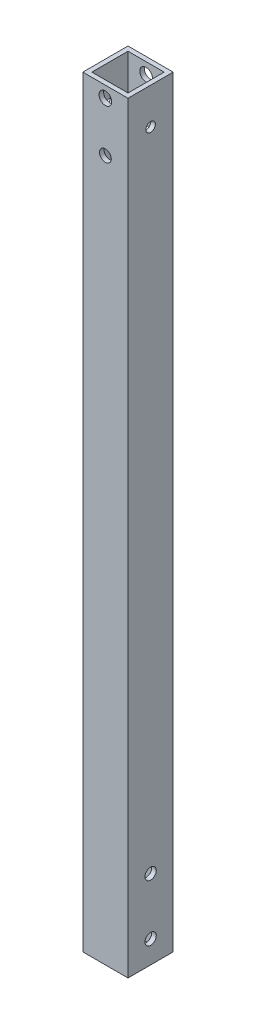
ISO-10303-21;
HEADER;
FILE_DESCRIPTION(('STEP AP214'),'2;1');
FILE_NAME('part.step','',(''),(''),'','','');
FILE_SCHEMA(('AUTOMOTIVE_DESIGN { 1 0 10303 214 1 1 1 1 }'));
ENDSEC;
DATA;
#1=APPLICATION_CONTEXT('core data for automotive mechanical design processes');
#2=APPLICATION_PROTOCOL_DEFINITION('international standard','automotive_design',2000,#1);
#3=PRODUCT_CONTEXT('',#1,'mechanical');
#4=PRODUCT('Part','Part','',(#3));
#5=PRODUCT_RELATED_PRODUCT_CATEGORY('part','',(#4));
#6=PRODUCT_DEFINITION_FORMATION('','',#4);
#7=PRODUCT_DEFINITION_CONTEXT('part definition',#1,'design');
#8=PRODUCT_DEFINITION('design','',#6,#7);
#9=PRODUCT_DEFINITION_SHAPE('','',#8);
#10=(LENGTH_UNIT() NAMED_UNIT(*) SI_UNIT(.MILLI.,.METRE.));
#11=(NAMED_UNIT(*) PLANE_ANGLE_UNIT() SI_UNIT($,.RADIAN.));
#12=(NAMED_UNIT(*) SI_UNIT($,.STERADIAN.) SOLID_ANGLE_UNIT());
#13=UNCERTAINTY_MEASURE_WITH_UNIT(LENGTH_MEASURE(1.E-05),#10,'distance_accuracy_value','');
#14=(GEOMETRIC_REPRESENTATION_CONTEXT(3) GLOBAL_UNCERTAINTY_ASSIGNED_CONTEXT((#13)) GLOBAL_UNIT_ASSIGNED_CONTEXT((#10,
#11,#12)) REPRESENTATION_CONTEXT('',''));
#15=CARTESIAN_POINT('',(0.,0.,0.));
#16=DIRECTION('',(0.,0.,1.));
#17=DIRECTION('',(1.,0.,0.));
#18=AXIS2_PLACEMENT_3D('',#15,#16,#17);
#19=CARTESIAN_POINT('',(0.,337.,0.));
#20=DIRECTION('',(0.,1.,0.));
#21=DIRECTION('',(0.,0.,1.));
#22=AXIS2_PLACEMENT_3D('',#19,#20,#21);
#23=PLANE('',#22);
#24=DIRECTION('',(0.,0.,1.));
#25=VECTOR('',#24,1.);
#26=CARTESIAN_POINT('',(0.,337.,0.));
#27=LINE('',#26,#25);
#28=CARTESIAN_POINT('',(0.,337.,-20.));
#29=VERTEX_POINT('',#28);
#30=CARTESIAN_POINT('',(0.,337.,0.));
#31=VERTEX_POINT('',#30);
#32=EDGE_CURVE('E166',#29,#31,#27,.T.);
#33=ORIENTED_EDGE('',*,*,#32,.T.);
#34=DIRECTION('',(1.,0.,0.));
#35=VECTOR('',#34,1.);
#36=CARTESIAN_POINT('',(0.,337.,0.));
#37=LINE('',#36,#35);
#38=CARTESIAN_POINT('',(20.,337.,0.));
#39=VERTEX_POINT('',#38);
#40=EDGE_CURVE('E169',#31,#39,#37,.T.);
#41=ORIENTED_EDGE('',*,*,#40,.T.);
#42=DIRECTION('',(0.,0.,-1.));
#43=VECTOR('',#42,1.);
#44=CARTESIAN_POINT('',(20.,337.,0.));
#45=LINE('',#44,#43);
#46=CARTESIAN_POINT('',(20.,337.,-20.));
#47=VERTEX_POINT('',#46);
#48=EDGE_CURVE('E172',#39,#47,#45,.T.);
#49=ORIENTED_EDGE('',*,*,#48,.T.);
#50=DIRECTION('',(-1.,0.,0.));
#51=VECTOR('',#50,1.);
#52=CARTESIAN_POINT('',(0.,337.,-20.));
#53=LINE('',#52,#51);
#54=EDGE_CURVE('E174',#47,#29,#53,.T.);
#55=ORIENTED_EDGE('',*,*,#54,.T.);
#56=EDGE_LOOP('',(#33,#41,#49,#55));
#57=FACE_BOUND('',#56,.T.);
#58=DIRECTION('',(1.,0.,0.));
#59=VECTOR('',#58,1.);
#60=CARTESIAN_POINT('',(0.,337.,-2.));
#61=LINE('',#60,#59);
#62=CARTESIAN_POINT('',(2.,337.,-2.));
#63=VERTEX_POINT('',#62);
#64=CARTESIAN_POINT('',(18.,337.,-2.));
#65=VERTEX_POINT('',#64);
#66=EDGE_CURVE('E136',#63,#65,#61,.T.);
#67=ORIENTED_EDGE('',*,*,#66,.F.);
#68=DIRECTION('',(0.,0.,1.));
#69=VECTOR('',#68,1.);
#70=CARTESIAN_POINT('',(2.,337.,0.));
#71=LINE('',#70,#69);
#72=CARTESIAN_POINT('',(2.,337.,-18.));
#73=VERTEX_POINT('',#72);
#74=EDGE_CURVE('E128',#73,#63,#71,.T.);
#75=ORIENTED_EDGE('',*,*,#74,.F.);
#76=DIRECTION('',(-1.,0.,0.));
#77=VECTOR('',#76,1.);
#78=CARTESIAN_POINT('',(0.,337.,-18.));
#79=LINE('',#78,#77);
#80=CARTESIAN_POINT('',(18.,337.,-18.));
#81=VERTEX_POINT('',#80);
#82=EDGE_CURVE('E150',#81,#73,#79,.T.);
#83=ORIENTED_EDGE('',*,*,#82,.F.);
#84=DIRECTION('',(0.,0.,-1.));
#85=VECTOR('',#84,1.);
#86=CARTESIAN_POINT('',(18.,337.,0.));
#87=LINE('',#86,#85);
#88=EDGE_CURVE('E148',#65,#81,#87,.T.);
#89=ORIENTED_EDGE('',*,*,#88,.F.);
#90=EDGE_LOOP('',(#67,#75,#83,#89));
#91=FACE_BOUND('',#90,.T.);
#92=ADVANCED_FACE('F61',(#57,#91),#23,.T.);
#93=CARTESIAN_POINT('',(0.,0.,0.));
#94=DIRECTION('',(0.,1.,0.));
#95=DIRECTION('',(0.,0.,1.));
#96=AXIS2_PLACEMENT_3D('',#93,#94,#95);
#97=PLANE('',#96);
#98=DIRECTION('',(0.,0.,1.));
#99=VECTOR('',#98,1.);
#100=CARTESIAN_POINT('',(0.,0.,0.));
#101=LINE('',#100,#99);
#102=CARTESIAN_POINT('',(0.,0.,-20.));
#103=VERTEX_POINT('',#102);
#104=CARTESIAN_POINT('',(0.,0.,0.));
#105=VERTEX_POINT('',#104);
#106=EDGE_CURVE('E144',#103,#105,#101,.T.);
#107=ORIENTED_EDGE('',*,*,#106,.F.);
#108=DIRECTION('',(-1.,0.,0.));
#109=VECTOR('',#108,1.);
#110=CARTESIAN_POINT('',(0.,0.,-20.));
#111=LINE('',#110,#109);
#112=CARTESIAN_POINT('',(20.,0.,-20.));
#113=VERTEX_POINT('',#112);
#114=EDGE_CURVE('E170',#113,#103,#111,.T.);
#115=ORIENTED_EDGE('',*,*,#114,.F.);
#116=DIRECTION('',(0.,0.,-1.));
#117=VECTOR('',#116,1.);
#118=CARTESIAN_POINT('',(20.,0.,0.));
#119=LINE('',#118,#117);
#120=CARTESIAN_POINT('',(20.,0.,0.));
#121=VERTEX_POINT('',#120);
#122=EDGE_CURVE('E181',#121,#113,#119,.T.);
#123=ORIENTED_EDGE('',*,*,#122,.F.);
#124=DIRECTION('',(1.,0.,0.));
#125=VECTOR('',#124,1.);
#126=CARTESIAN_POINT('',(0.,0.,0.));
#127=LINE('',#126,#125);
#128=EDGE_CURVE('E179',#105,#121,#127,.T.);
#129=ORIENTED_EDGE('',*,*,#128,.F.);
#130=EDGE_LOOP('',(#107,#115,#123,#129));
#131=FACE_BOUND('',#130,.T.);
#132=DIRECTION('',(0.,0.,1.));
#133=VECTOR('',#132,1.);
#134=CARTESIAN_POINT('',(2.,0.,0.));
#135=LINE('',#134,#133);
#136=CARTESIAN_POINT('',(2.,0.,-18.));
#137=VERTEX_POINT('',#136);
#138=CARTESIAN_POINT('',(2.,0.,-2.));
#139=VERTEX_POINT('',#138);
#140=EDGE_CURVE('E86',#137,#139,#135,.T.);
#141=ORIENTED_EDGE('',*,*,#140,.T.);
#142=DIRECTION('',(1.,0.,0.));
#143=VECTOR('',#142,1.);
#144=CARTESIAN_POINT('',(0.,0.,-2.));
#145=LINE('',#144,#143);
#146=CARTESIAN_POINT('',(18.,0.,-2.));
#147=VERTEX_POINT('',#146);
#148=EDGE_CURVE('E143',#139,#147,#145,.T.);
#149=ORIENTED_EDGE('',*,*,#148,.T.);
#150=DIRECTION('',(0.,0.,-1.));
#151=VECTOR('',#150,1.);
#152=CARTESIAN_POINT('',(18.,0.,0.));
#153=LINE('',#152,#151);
#154=CARTESIAN_POINT('',(18.,0.,-18.));
#155=VERTEX_POINT('',#154);
#156=EDGE_CURVE('E158',#147,#155,#153,.T.);
#157=ORIENTED_EDGE('',*,*,#156,.T.);
#158=DIRECTION('',(-1.,0.,0.));
#159=VECTOR('',#158,1.);
#160=CARTESIAN_POINT('',(0.,0.,-18.));
#161=LINE('',#160,#159);
#162=EDGE_CURVE('E137',#155,#137,#161,.T.);
#163=ORIENTED_EDGE('',*,*,#162,.T.);
#164=EDGE_LOOP('',(#141,#149,#157,#163));
#165=FACE_BOUND('',#164,.T.);
#166=ADVANCED_FACE('F254',(#131,#165),#97,.F.);
#167=CARTESIAN_POINT('',(0.,337.,0.));
#168=DIRECTION('',(1.,0.,0.));
#169=DIRECTION('',(0.,0.,-1.));
#170=AXIS2_PLACEMENT_3D('',#167,#168,#169);
#171=PLANE('',#170);
#172=CARTESIAN_POINT('',(0.,321.,-10.));
#173=DIRECTION('',(1.,0.,0.));
#174=DIRECTION('',(0.,0.,-1.));
#175=AXIS2_PLACEMENT_3D('',#172,#173,#174);
#176=CIRCLE('',#175,2.1);
#177=CARTESIAN_POINT('',(0.,321.,-12.1));
#178=VERTEX_POINT('',#177);
#179=EDGE_CURVE('E332',#178,#178,#176,.T.);
#180=ORIENTED_EDGE('',*,*,#179,.T.);
#181=EDGE_LOOP('',(#180));
#182=FACE_BOUND('',#181,.T.);
#183=CARTESIAN_POINT('',(0.,34.9999999999969,-10.0000000000083));
#184=DIRECTION('',(-1.,0.,0.));
#185=DIRECTION('',(0.,0.,1.));
#186=AXIS2_PLACEMENT_3D('',#183,#184,#185);
#187=CIRCLE('',#186,2.5);
#188=CARTESIAN_POINT('',(0.,34.9999999999969,-7.50000000000833));
#189=VERTEX_POINT('',#188);
#190=EDGE_CURVE('E221',#189,#189,#187,.T.);
#191=ORIENTED_EDGE('',*,*,#190,.F.);
#192=EDGE_LOOP('',(#191));
#193=FACE_BOUND('',#192,.T.);
#194=CARTESIAN_POINT('',(0.,10.,-10.0000000000083));
#195=DIRECTION('',(-1.,0.,0.));
#196=DIRECTION('',(0.,0.,1.));
#197=AXIS2_PLACEMENT_3D('',#194,#195,#196);
#198=CIRCLE('',#197,2.5);
#199=CARTESIAN_POINT('',(0.,10.,-7.50000000000833));
#200=VERTEX_POINT('',#199);
#201=EDGE_CURVE('E209',#200,#200,#198,.T.);
#202=ORIENTED_EDGE('',*,*,#201,.F.);
#203=EDGE_LOOP('',(#202));
#204=FACE_BOUND('',#203,.T.);
#205=ORIENTED_EDGE('',*,*,#106,.T.);
#206=DIRECTION('',(0.,-1.,0.));
#207=VECTOR('',#206,1.);
#208=CARTESIAN_POINT('',(0.,337.,0.));
#209=LINE('',#208,#207);
#210=EDGE_CURVE('E12',#31,#105,#209,.T.);
#211=ORIENTED_EDGE('',*,*,#210,.F.);
#212=ORIENTED_EDGE('',*,*,#32,.F.);
#213=DIRECTION('',(0.,-1.,0.));
#214=VECTOR('',#213,1.);
#215=CARTESIAN_POINT('',(0.,337.,-20.));
#216=LINE('',#215,#214);
#217=EDGE_CURVE('E176',#29,#103,#216,.T.);
#218=ORIENTED_EDGE('',*,*,#217,.T.);
#219=EDGE_LOOP('',(#205,#211,#212,#218));
#220=FACE_BOUND('',#219,.T.);
#221=ADVANCED_FACE('F63',(#182,#193,#204,#220),#171,.F.);
#222=CARTESIAN_POINT('',(0.,337.,0.));
#223=DIRECTION('',(0.,0.,-1.));
#224=DIRECTION('',(-1.,0.,0.));
#225=AXIS2_PLACEMENT_3D('',#222,#223,#224);
#226=PLANE('',#225);
#227=CARTESIAN_POINT('',(9.99999999999981,310.,0.));
#228=DIRECTION('',(0.,0.,-1.));
#229=DIRECTION('',(-1.,0.,0.));
#230=AXIS2_PLACEMENT_3D('',#227,#228,#229);
#231=CIRCLE('',#230,2.6);
#232=CARTESIAN_POINT('',(7.39999999999981,310.,0.));
#233=VERTEX_POINT('',#232);
#234=EDGE_CURVE('E202',#233,#233,#231,.T.);
#235=ORIENTED_EDGE('',*,*,#234,.T.);
#236=EDGE_LOOP('',(#235));
#237=FACE_BOUND('',#236,.T.);
#238=CARTESIAN_POINT('',(9.99999999999982,332.,0.));
#239=DIRECTION('',(0.,0.,-1.));
#240=DIRECTION('',(-1.,0.,0.));
#241=AXIS2_PLACEMENT_3D('',#238,#239,#240);
#242=CIRCLE('',#241,2.8);
#243=CARTESIAN_POINT('',(7.19999999999981,332.,0.));
#244=VERTEX_POINT('',#243);
#245=EDGE_CURVE('E344',#244,#244,#242,.T.);
#246=ORIENTED_EDGE('',*,*,#245,.T.);
#247=EDGE_LOOP('',(#246));
#248=FACE_BOUND('',#247,.T.);
#249=ORIENTED_EDGE('',*,*,#128,.T.);
#250=DIRECTION('',(0.,-1.,0.));
#251=VECTOR('',#250,1.);
#252=CARTESIAN_POINT('',(20.,337.,0.));
#253=LINE('',#252,#251);
#254=EDGE_CURVE('E70',#39,#121,#253,.T.);
#255=ORIENTED_EDGE('',*,*,#254,.F.);
#256=ORIENTED_EDGE('',*,*,#40,.F.);
#257=ORIENTED_EDGE('',*,*,#210,.T.);
#258=EDGE_LOOP('',(#249,#255,#256,#257));
#259=FACE_BOUND('',#258,.T.);
#260=ADVANCED_FACE('F253',(#237,#248,#259),#226,.F.);
#261=CARTESIAN_POINT('',(20.,337.,0.));
#262=DIRECTION('',(-1.,0.,0.));
#263=DIRECTION('',(0.,0.,1.));
#264=AXIS2_PLACEMENT_3D('',#261,#262,#263);
#265=PLANE('',#264);
#266=CARTESIAN_POINT('',(20.,321.,-10.));
#267=DIRECTION('',(1.,0.,0.));
#268=DIRECTION('',(0.,0.,-1.));
#269=AXIS2_PLACEMENT_3D('',#266,#267,#268);
#270=CIRCLE('',#269,2.1);
#271=CARTESIAN_POINT('',(20.,321.,-12.1));
#272=VERTEX_POINT('',#271);
#273=EDGE_CURVE('E331',#272,#272,#270,.T.);
#274=ORIENTED_EDGE('',*,*,#273,.F.);
#275=EDGE_LOOP('',(#274));
#276=FACE_BOUND('',#275,.T.);
#277=CARTESIAN_POINT('',(20.,34.9999999999969,-10.0000000000083));
#278=DIRECTION('',(-1.,0.,0.));
#279=DIRECTION('',(0.,0.,1.));
#280=AXIS2_PLACEMENT_3D('',#277,#278,#279);
#281=CIRCLE('',#280,2.5);
#282=CARTESIAN_POINT('',(20.,34.9999999999969,-7.50000000000833));
#283=VERTEX_POINT('',#282);
#284=EDGE_CURVE('E195',#283,#283,#281,.T.);
#285=ORIENTED_EDGE('',*,*,#284,.T.);
#286=EDGE_LOOP('',(#285));
#287=FACE_BOUND('',#286,.T.);
#288=CARTESIAN_POINT('',(20.,10.,-10.0000000000083));
#289=DIRECTION('',(-1.,0.,0.));
#290=DIRECTION('',(0.,0.,1.));
#291=AXIS2_PLACEMENT_3D('',#288,#289,#290);
#292=CIRCLE('',#291,2.5);
#293=CARTESIAN_POINT('',(20.,10.,-7.50000000000833));
#294=VERTEX_POINT('',#293);
#295=EDGE_CURVE('E224',#294,#294,#292,.T.);
#296=ORIENTED_EDGE('',*,*,#295,.T.);
#297=EDGE_LOOP('',(#296));
#298=FACE_BOUND('',#297,.T.);
#299=ORIENTED_EDGE('',*,*,#122,.T.);
#300=DIRECTION('',(0.,-1.,0.));
#301=VECTOR('',#300,1.);
#302=CARTESIAN_POINT('',(20.,337.,-20.));
#303=LINE('',#302,#301);
#304=EDGE_CURVE('E186',#47,#113,#303,.T.);
#305=ORIENTED_EDGE('',*,*,#304,.F.);
#306=ORIENTED_EDGE('',*,*,#48,.F.);
#307=ORIENTED_EDGE('',*,*,#254,.T.);
#308=EDGE_LOOP('',(#299,#305,#306,#307));
#309=FACE_BOUND('',#308,.T.);
#310=ADVANCED_FACE('F272',(#276,#287,#298,#309),#265,.F.);
#311=CARTESIAN_POINT('',(0.,337.,-20.));
#312=DIRECTION('',(0.,0.,1.));
#313=DIRECTION('',(1.,0.,0.));
#314=AXIS2_PLACEMENT_3D('',#311,#312,#313);
#315=PLANE('',#314);
#316=CARTESIAN_POINT('',(9.99999999999981,310.,-20.));
#317=DIRECTION('',(0.,0.,-1.));
#318=DIRECTION('',(-1.,0.,0.));
#319=AXIS2_PLACEMENT_3D('',#316,#317,#318);
#320=CIRCLE('',#319,2.6);
#321=CARTESIAN_POINT('',(7.39999999999981,310.,-20.));
#322=VERTEX_POINT('',#321);
#323=EDGE_CURVE('E342',#322,#322,#320,.T.);
#324=ORIENTED_EDGE('',*,*,#323,.F.);
#325=EDGE_LOOP('',(#324));
#326=FACE_BOUND('',#325,.T.);
#327=CARTESIAN_POINT('',(9.99999999999982,332.,-20.));
#328=DIRECTION('',(0.,0.,-1.));
#329=DIRECTION('',(-1.,0.,0.));
#330=AXIS2_PLACEMENT_3D('',#327,#328,#329);
#331=CIRCLE('',#330,2.8);
#332=CARTESIAN_POINT('',(7.19999999999981,332.,-20.));
#333=VERTEX_POINT('',#332);
#334=EDGE_CURVE('E216',#333,#333,#331,.T.);
#335=ORIENTED_EDGE('',*,*,#334,.F.);
#336=EDGE_LOOP('',(#335));
#337=FACE_BOUND('',#336,.T.);
#338=ORIENTED_EDGE('',*,*,#114,.T.);
#339=ORIENTED_EDGE('',*,*,#217,.F.);
#340=ORIENTED_EDGE('',*,*,#54,.F.);
#341=ORIENTED_EDGE('',*,*,#304,.T.);
#342=EDGE_LOOP('',(#338,#339,#340,#341));
#343=FACE_BOUND('',#342,.T.);
#344=ADVANCED_FACE('F238',(#326,#337,#343),#315,.F.);
#345=CARTESIAN_POINT('',(2.,337.,0.));
#346=DIRECTION('',(1.,0.,0.));
#347=DIRECTION('',(0.,0.,-1.));
#348=AXIS2_PLACEMENT_3D('',#345,#346,#347);
#349=PLANE('',#348);
#350=CARTESIAN_POINT('',(2.,321.,-10.));
#351=DIRECTION('',(1.,0.,0.));
#352=DIRECTION('',(0.,0.,-1.));
#353=AXIS2_PLACEMENT_3D('',#350,#351,#352);
#354=CIRCLE('',#353,2.1);
#355=CARTESIAN_POINT('',(2.,321.,-12.1));
#356=VERTEX_POINT('',#355);
#357=EDGE_CURVE('E337',#356,#356,#354,.T.);
#358=ORIENTED_EDGE('',*,*,#357,.F.);
#359=EDGE_LOOP('',(#358));
#360=FACE_BOUND('',#359,.T.);
#361=CARTESIAN_POINT('',(2.,34.9999999999969,-10.0000000000083));
#362=DIRECTION('',(1.,0.,0.));
#363=DIRECTION('',(0.,0.,-1.));
#364=AXIS2_PLACEMENT_3D('',#361,#362,#363);
#365=CIRCLE('',#364,2.5);
#366=CARTESIAN_POINT('',(2.,34.9999999999969,-12.5000000000083));
#367=VERTEX_POINT('',#366);
#368=EDGE_CURVE('E156',#367,#367,#365,.T.);
#369=ORIENTED_EDGE('',*,*,#368,.F.);
#370=EDGE_LOOP('',(#369));
#371=FACE_BOUND('',#370,.T.);
#372=CARTESIAN_POINT('',(2.,10.,-10.0000000000083));
#373=DIRECTION('',(1.,0.,0.));
#374=DIRECTION('',(0.,0.,-1.));
#375=AXIS2_PLACEMENT_3D('',#372,#373,#374);
#376=CIRCLE('',#375,2.5);
#377=CARTESIAN_POINT('',(2.,10.,-12.5000000000083));
#378=VERTEX_POINT('',#377);
#379=EDGE_CURVE('E194',#378,#378,#376,.T.);
#380=ORIENTED_EDGE('',*,*,#379,.F.);
#381=EDGE_LOOP('',(#380));
#382=FACE_BOUND('',#381,.T.);
#383=ORIENTED_EDGE('',*,*,#140,.F.);
#384=DIRECTION('',(0.,-1.,0.));
#385=VECTOR('',#384,1.);
#386=CARTESIAN_POINT('',(2.,337.,-18.));
#387=LINE('',#386,#385);
#388=EDGE_CURVE('E132',#73,#137,#387,.T.);
#389=ORIENTED_EDGE('',*,*,#388,.F.);
#390=ORIENTED_EDGE('',*,*,#74,.T.);
#391=DIRECTION('',(0.,-1.,0.));
#392=VECTOR('',#391,1.);
#393=CARTESIAN_POINT('',(2.,337.,-2.));
#394=LINE('',#393,#392);
#395=EDGE_CURVE('E131',#63,#139,#394,.T.);
#396=ORIENTED_EDGE('',*,*,#395,.T.);
#397=EDGE_LOOP('',(#383,#389,#390,#396));
#398=FACE_BOUND('',#397,.T.);
#399=ADVANCED_FACE('F130',(#360,#371,#382,#398),#349,.T.);
#400=CARTESIAN_POINT('',(0.,337.,-2.));
#401=DIRECTION('',(0.,0.,-1.));
#402=DIRECTION('',(-1.,0.,0.));
#403=AXIS2_PLACEMENT_3D('',#400,#401,#402);
#404=PLANE('',#403);
#405=CARTESIAN_POINT('',(9.99999999999981,310.,-2.));
#406=DIRECTION('',(0.,0.,-1.));
#407=DIRECTION('',(-1.,0.,0.));
#408=AXIS2_PLACEMENT_3D('',#405,#406,#407);
#409=CIRCLE('',#408,2.6);
#410=CARTESIAN_POINT('',(7.39999999999981,310.,-2.));
#411=VERTEX_POINT('',#410);
#412=EDGE_CURVE('E205',#411,#411,#409,.T.);
#413=ORIENTED_EDGE('',*,*,#412,.F.);
#414=EDGE_LOOP('',(#413));
#415=FACE_BOUND('',#414,.T.);
#416=CARTESIAN_POINT('',(9.99999999999982,332.,-2.));
#417=DIRECTION('',(0.,0.,-1.));
#418=DIRECTION('',(-1.,0.,0.));
#419=AXIS2_PLACEMENT_3D('',#416,#417,#418);
#420=CIRCLE('',#419,2.8);
#421=CARTESIAN_POINT('',(7.19999999999981,332.,-2.));
#422=VERTEX_POINT('',#421);
#423=EDGE_CURVE('E201',#422,#422,#420,.T.);
#424=ORIENTED_EDGE('',*,*,#423,.F.);
#425=EDGE_LOOP('',(#424));
#426=FACE_BOUND('',#425,.T.);
#427=ORIENTED_EDGE('',*,*,#148,.F.);
#428=ORIENTED_EDGE('',*,*,#395,.F.);
#429=ORIENTED_EDGE('',*,*,#66,.T.);
#430=DIRECTION('',(0.,-1.,0.));
#431=VECTOR('',#430,1.);
#432=CARTESIAN_POINT('',(18.,337.,-2.));
#433=LINE('',#432,#431);
#434=EDGE_CURVE('E145',#65,#147,#433,.T.);
#435=ORIENTED_EDGE('',*,*,#434,.T.);
#436=EDGE_LOOP('',(#427,#428,#429,#435));
#437=FACE_BOUND('',#436,.T.);
#438=ADVANCED_FACE('F140',(#415,#426,#437),#404,.T.);
#439=CARTESIAN_POINT('',(18.,337.,0.));
#440=DIRECTION('',(-1.,0.,0.));
#441=DIRECTION('',(0.,0.,1.));
#442=AXIS2_PLACEMENT_3D('',#439,#440,#441);
#443=PLANE('',#442);
#444=CARTESIAN_POINT('',(18.,321.,-10.));
#445=DIRECTION('',(-1.,0.,0.));
#446=DIRECTION('',(0.,0.,1.));
#447=AXIS2_PLACEMENT_3D('',#444,#445,#446);
#448=CIRCLE('',#447,2.1);
#449=CARTESIAN_POINT('',(18.,321.,-7.9));
#450=VERTEX_POINT('',#449);
#451=EDGE_CURVE('E65',#450,#450,#448,.T.);
#452=ORIENTED_EDGE('',*,*,#451,.F.);
#453=EDGE_LOOP('',(#452));
#454=FACE_BOUND('',#453,.T.);
#455=CARTESIAN_POINT('',(18.,34.9999999999969,-10.0000000000083));
#456=DIRECTION('',(-1.,0.,0.));
#457=DIRECTION('',(0.,0.,1.));
#458=AXIS2_PLACEMENT_3D('',#455,#456,#457);
#459=CIRCLE('',#458,2.5);
#460=CARTESIAN_POINT('',(18.,34.9999999999969,-7.50000000000833));
#461=VERTEX_POINT('',#460);
#462=EDGE_CURVE('E196',#461,#461,#459,.T.);
#463=ORIENTED_EDGE('',*,*,#462,.F.);
#464=EDGE_LOOP('',(#463));
#465=FACE_BOUND('',#464,.T.);
#466=CARTESIAN_POINT('',(18.,10.,-10.0000000000083));
#467=DIRECTION('',(-1.,0.,0.));
#468=DIRECTION('',(0.,0.,1.));
#469=AXIS2_PLACEMENT_3D('',#466,#467,#468);
#470=CIRCLE('',#469,2.5);
#471=CARTESIAN_POINT('',(18.,10.,-7.50000000000833));
#472=VERTEX_POINT('',#471);
#473=EDGE_CURVE('E191',#472,#472,#470,.T.);
#474=ORIENTED_EDGE('',*,*,#473,.F.);
#475=EDGE_LOOP('',(#474));
#476=FACE_BOUND('',#475,.T.);
#477=ORIENTED_EDGE('',*,*,#156,.F.);
#478=ORIENTED_EDGE('',*,*,#434,.F.);
#479=ORIENTED_EDGE('',*,*,#88,.T.);
#480=DIRECTION('',(0.,-1.,0.));
#481=VECTOR('',#480,1.);
#482=CARTESIAN_POINT('',(18.,337.,-18.));
#483=LINE('',#482,#481);
#484=EDGE_CURVE('E78',#81,#155,#483,.T.);
#485=ORIENTED_EDGE('',*,*,#484,.T.);
#486=EDGE_LOOP('',(#477,#478,#479,#485));
#487=FACE_BOUND('',#486,.T.);
#488=ADVANCED_FACE('F294',(#454,#465,#476,#487),#443,.T.);
#489=CARTESIAN_POINT('',(0.,337.,-18.));
#490=DIRECTION('',(0.,0.,1.));
#491=DIRECTION('',(1.,0.,0.));
#492=AXIS2_PLACEMENT_3D('',#489,#490,#491);
#493=PLANE('',#492);
#494=CARTESIAN_POINT('',(9.99999999999981,310.,-18.));
#495=DIRECTION('',(0.,0.,1.));
#496=DIRECTION('',(1.,0.,0.));
#497=AXIS2_PLACEMENT_3D('',#494,#495,#496);
#498=CIRCLE('',#497,2.6);
#499=CARTESIAN_POINT('',(12.5999999999998,310.,-18.));
#500=VERTEX_POINT('',#499);
#501=EDGE_CURVE('E203',#500,#500,#498,.T.);
#502=ORIENTED_EDGE('',*,*,#501,.F.);
#503=EDGE_LOOP('',(#502));
#504=FACE_BOUND('',#503,.T.);
#505=CARTESIAN_POINT('',(9.99999999999982,332.,-18.));
#506=DIRECTION('',(0.,0.,1.));
#507=DIRECTION('',(1.,0.,0.));
#508=AXIS2_PLACEMENT_3D('',#505,#506,#507);
#509=CIRCLE('',#508,2.8);
#510=CARTESIAN_POINT('',(12.7999999999998,332.,-18.));
#511=VERTEX_POINT('',#510);
#512=EDGE_CURVE('E199',#511,#511,#509,.T.);
#513=ORIENTED_EDGE('',*,*,#512,.F.);
#514=EDGE_LOOP('',(#513));
#515=FACE_BOUND('',#514,.T.);
#516=ORIENTED_EDGE('',*,*,#162,.F.);
#517=ORIENTED_EDGE('',*,*,#484,.F.);
#518=ORIENTED_EDGE('',*,*,#82,.T.);
#519=ORIENTED_EDGE('',*,*,#388,.T.);
#520=EDGE_LOOP('',(#516,#517,#518,#519));
#521=FACE_BOUND('',#520,.T.);
#522=ADVANCED_FACE('F298',(#504,#515,#521),#493,.T.);
#523=CARTESIAN_POINT('',(20.,10.,-10.0000000000083));
#524=DIRECTION('',(-1.,0.,0.));
#525=DIRECTION('',(0.,0.,1.));
#526=AXIS2_PLACEMENT_3D('',#523,#524,#525);
#527=CYLINDRICAL_SURFACE('',#526,2.5);
#528=ORIENTED_EDGE('',*,*,#473,.T.);
#529=EDGE_LOOP('',(#528));
#530=FACE_BOUND('',#529,.T.);
#531=ORIENTED_EDGE('',*,*,#295,.F.);
#532=EDGE_LOOP('',(#531));
#533=FACE_BOUND('',#532,.T.);
#534=ADVANCED_FACE('F248',(#530,#533),#527,.F.);
#535=CARTESIAN_POINT('',(20.,34.9999999999969,-10.0000000000083));
#536=DIRECTION('',(-1.,0.,0.));
#537=DIRECTION('',(0.,0.,1.));
#538=AXIS2_PLACEMENT_3D('',#535,#536,#537);
#539=CYLINDRICAL_SURFACE('',#538,2.5);
#540=ORIENTED_EDGE('',*,*,#462,.T.);
#541=EDGE_LOOP('',(#540));
#542=FACE_BOUND('',#541,.T.);
#543=ORIENTED_EDGE('',*,*,#284,.F.);
#544=EDGE_LOOP('',(#543));
#545=FACE_BOUND('',#544,.T.);
#546=ADVANCED_FACE('F246',(#542,#545),#539,.F.);
#547=ORIENTED_EDGE('',*,*,#379,.T.);
#548=EDGE_LOOP('',(#547));
#549=FACE_BOUND('',#548,.T.);
#550=ORIENTED_EDGE('',*,*,#201,.T.);
#551=EDGE_LOOP('',(#550));
#552=FACE_BOUND('',#551,.T.);
#553=ADVANCED_FACE('F243',(#549,#552),#527,.F.);
#554=ORIENTED_EDGE('',*,*,#368,.T.);
#555=EDGE_LOOP('',(#554));
#556=FACE_BOUND('',#555,.T.);
#557=ORIENTED_EDGE('',*,*,#190,.T.);
#558=EDGE_LOOP('',(#557));
#559=FACE_BOUND('',#558,.T.);
#560=ADVANCED_FACE('F233',(#556,#559),#539,.F.);
#561=CARTESIAN_POINT('',(9.99999999999982,332.,0.));
#562=DIRECTION('',(0.,0.,-1.));
#563=DIRECTION('',(-1.,0.,0.));
#564=AXIS2_PLACEMENT_3D('',#561,#562,#563);
#565=CYLINDRICAL_SURFACE('',#564,2.8);
#566=ORIENTED_EDGE('',*,*,#512,.T.);
#567=EDGE_LOOP('',(#566));
#568=FACE_BOUND('',#567,.T.);
#569=ORIENTED_EDGE('',*,*,#334,.T.);
#570=EDGE_LOOP('',(#569));
#571=FACE_BOUND('',#570,.T.);
#572=ADVANCED_FACE('F308',(#568,#571),#565,.F.);
#573=CARTESIAN_POINT('',(9.99999999999981,310.,0.));
#574=DIRECTION('',(0.,0.,-1.));
#575=DIRECTION('',(-1.,0.,0.));
#576=AXIS2_PLACEMENT_3D('',#573,#574,#575);
#577=CYLINDRICAL_SURFACE('',#576,2.6);
#578=ORIENTED_EDGE('',*,*,#501,.T.);
#579=EDGE_LOOP('',(#578));
#580=FACE_BOUND('',#579,.T.);
#581=ORIENTED_EDGE('',*,*,#323,.T.);
#582=EDGE_LOOP('',(#581));
#583=FACE_BOUND('',#582,.T.);
#584=ADVANCED_FACE('F311',(#580,#583),#577,.F.);
#585=ORIENTED_EDGE('',*,*,#423,.T.);
#586=EDGE_LOOP('',(#585));
#587=FACE_BOUND('',#586,.T.);
#588=ORIENTED_EDGE('',*,*,#245,.F.);
#589=EDGE_LOOP('',(#588));
#590=FACE_BOUND('',#589,.T.);
#591=ADVANCED_FACE('F313',(#587,#590),#565,.F.);
#592=ORIENTED_EDGE('',*,*,#412,.T.);
#593=EDGE_LOOP('',(#592));
#594=FACE_BOUND('',#593,.T.);
#595=ORIENTED_EDGE('',*,*,#234,.F.);
#596=EDGE_LOOP('',(#595));
#597=FACE_BOUND('',#596,.T.);
#598=ADVANCED_FACE('F316',(#594,#597),#577,.F.);
#599=CARTESIAN_POINT('',(0.,321.,-10.));
#600=DIRECTION('',(1.,0.,0.));
#601=DIRECTION('',(0.,0.,-1.));
#602=AXIS2_PLACEMENT_3D('',#599,#600,#601);
#603=CYLINDRICAL_SURFACE('',#602,2.1);
#604=ORIENTED_EDGE('',*,*,#451,.T.);
#605=EDGE_LOOP('',(#604));
#606=FACE_BOUND('',#605,.T.);
#607=ORIENTED_EDGE('',*,*,#273,.T.);
#608=EDGE_LOOP('',(#607));
#609=FACE_BOUND('',#608,.T.);
#610=ADVANCED_FACE('F317',(#606,#609),#603,.F.);
#611=ORIENTED_EDGE('',*,*,#357,.T.);
#612=EDGE_LOOP('',(#611));
#613=FACE_BOUND('',#612,.T.);
#614=ORIENTED_EDGE('',*,*,#179,.F.);
#615=EDGE_LOOP('',(#614));
#616=FACE_BOUND('',#615,.T.);
#617=ADVANCED_FACE('F319',(#613,#616),#603,.F.);
#618=CLOSED_SHELL('',(#92,#166,#221,#260,#310,#344,#399,#438,#488,#522,#534,#546,#553,#560,#572,
#584,#591,#598,#610,#617));
#619=MANIFOLD_SOLID_BREP('B2',#618);
#620=ADVANCED_BREP_SHAPE_REPRESENTATION('',(#18,#619),#14);
#621=SHAPE_DEFINITION_REPRESENTATION(#9,#620);
ENDSEC;
END-ISO-10303-21;
